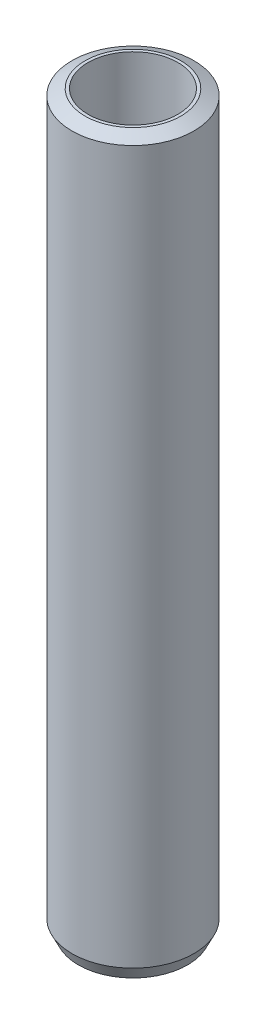
ISO-10303-21;
HEADER;
FILE_DESCRIPTION(('STEP AP214'),'2;1');
FILE_NAME('part.step','',(''),(''),'','','');
FILE_SCHEMA(('AUTOMOTIVE_DESIGN { 1 0 10303 214 1 1 1 1 }'));
ENDSEC;
DATA;
#1=APPLICATION_CONTEXT('core data for automotive mechanical design processes');
#2=APPLICATION_PROTOCOL_DEFINITION('international standard','automotive_design',2000,#1);
#3=PRODUCT_CONTEXT('',#1,'mechanical');
#4=PRODUCT('Part','Part','',(#3));
#5=PRODUCT_RELATED_PRODUCT_CATEGORY('part','',(#4));
#6=PRODUCT_DEFINITION_FORMATION('','',#4);
#7=PRODUCT_DEFINITION_CONTEXT('part definition',#1,'design');
#8=PRODUCT_DEFINITION('design','',#6,#7);
#9=PRODUCT_DEFINITION_SHAPE('','',#8);
#10=(LENGTH_UNIT() NAMED_UNIT(*) SI_UNIT(.MILLI.,.METRE.));
#11=(NAMED_UNIT(*) PLANE_ANGLE_UNIT() SI_UNIT($,.RADIAN.));
#12=(NAMED_UNIT(*) SI_UNIT($,.STERADIAN.) SOLID_ANGLE_UNIT());
#13=UNCERTAINTY_MEASURE_WITH_UNIT(LENGTH_MEASURE(1.E-05),#10,'distance_accuracy_value','');
#14=(GEOMETRIC_REPRESENTATION_CONTEXT(3) GLOBAL_UNCERTAINTY_ASSIGNED_CONTEXT((#13)) GLOBAL_UNIT_ASSIGNED_CONTEXT((#10,
#11,#12)) REPRESENTATION_CONTEXT('',''));
#15=CARTESIAN_POINT('',(0.,0.,0.));
#16=DIRECTION('',(0.,0.,1.));
#17=DIRECTION('',(1.,0.,0.));
#18=AXIS2_PLACEMENT_3D('',#15,#16,#17);
#19=CARTESIAN_POINT('',(0.,600.,0.));
#20=DIRECTION('',(0.,-1.,0.));
#21=DIRECTION('',(0.,0.,-1.));
#22=AXIS2_PLACEMENT_3D('',#19,#20,#21);
#23=CYLINDRICAL_SURFACE('',#22,50.);
#24=CARTESIAN_POINT('',(0.,594.768643446962,0.));
#25=DIRECTION('',(0.,1.,0.));
#26=DIRECTION('',(0.,0.,1.));
#27=AXIS2_PLACEMENT_3D('',#24,#25,#26);
#28=CIRCLE('',#27,50.);
#29=CARTESIAN_POINT('',(0.,594.768643446962,50.));
#30=VERTEX_POINT('',#29);
#31=EDGE_CURVE('E50',#30,#30,#28,.F.);
#32=ORIENTED_EDGE('',*,*,#31,.T.);
#33=EDGE_LOOP('',(#32));
#34=FACE_BOUND('',#33,.T.);
#35=CARTESIAN_POINT('',(0.,10.6760172350044,0.));
#36=DIRECTION('',(0.,1.,0.));
#37=DIRECTION('',(0.,0.,1.));
#38=AXIS2_PLACEMENT_3D('',#35,#36,#37);
#39=CIRCLE('',#38,50.);
#40=CARTESIAN_POINT('',(0.,10.6760172350044,50.));
#41=VERTEX_POINT('',#40);
#42=EDGE_CURVE('E51',#41,#41,#39,.T.);
#43=ORIENTED_EDGE('',*,*,#42,.T.);
#44=EDGE_LOOP('',(#43));
#45=FACE_BOUND('',#44,.T.);
#46=ADVANCED_FACE('F39',(#34,#45),#23,.T.);
#47=CARTESIAN_POINT('',(0.,600.,0.));
#48=DIRECTION('',(0.,1.,0.));
#49=DIRECTION('',(0.,0.,1.));
#50=AXIS2_PLACEMENT_3D('',#47,#48,#49);
#51=PLANE('',#50);
#52=CARTESIAN_POINT('',(0.,600.,0.));
#53=DIRECTION('',(0.,1.,0.));
#54=DIRECTION('',(0.,0.,1.));
#55=AXIS2_PLACEMENT_3D('',#52,#53,#54);
#56=CIRCLE('',#55,39.3239827649952);
#57=CARTESIAN_POINT('',(0.,600.,39.3239827649952));
#58=VERTEX_POINT('',#57);
#59=EDGE_CURVE('E54',#58,#58,#56,.T.);
#60=ORIENTED_EDGE('',*,*,#59,.T.);
#61=EDGE_LOOP('',(#60));
#62=FACE_BOUND('',#61,.T.);
#63=CARTESIAN_POINT('',(0.,600.,0.));
#64=DIRECTION('',(0.,1.,0.));
#65=DIRECTION('',(0.,0.,1.));
#66=AXIS2_PLACEMENT_3D('',#63,#64,#65);
#67=CIRCLE('',#66,36.8508872725705);
#68=CARTESIAN_POINT('',(0.,600.,36.8508872725705));
#69=VERTEX_POINT('',#68);
#70=EDGE_CURVE('E58',#69,#69,#67,.T.);
#71=ORIENTED_EDGE('',*,*,#70,.F.);
#72=EDGE_LOOP('',(#71));
#73=FACE_BOUND('',#72,.T.);
#74=ADVANCED_FACE('F69',(#62,#73),#51,.T.);
#75=CARTESIAN_POINT('',(0.,0.,0.));
#76=DIRECTION('',(0.,1.,0.));
#77=DIRECTION('',(0.,0.,1.));
#78=AXIS2_PLACEMENT_3D('',#75,#76,#77);
#79=PLANE('',#78);
#80=CARTESIAN_POINT('',(0.,0.,0.));
#81=DIRECTION('',(0.,1.,0.));
#82=DIRECTION('',(0.,0.,1.));
#83=AXIS2_PLACEMENT_3D('',#80,#81,#82);
#84=CIRCLE('',#83,44.7686434469622);
#85=CARTESIAN_POINT('',(0.,0.,44.7686434469622));
#86=VERTEX_POINT('',#85);
#87=EDGE_CURVE('E10',#86,#86,#84,.F.);
#88=ORIENTED_EDGE('',*,*,#87,.T.);
#89=EDGE_LOOP('',(#88));
#90=FACE_BOUND('',#89,.T.);
#91=CARTESIAN_POINT('',(0.,0.,0.));
#92=DIRECTION('',(0.,1.,0.));
#93=DIRECTION('',(0.,0.,1.));
#94=AXIS2_PLACEMENT_3D('',#91,#92,#93);
#95=CIRCLE('',#94,36.8508872725705);
#96=CARTESIAN_POINT('',(0.,0.,36.8508872725705));
#97=VERTEX_POINT('',#96);
#98=EDGE_CURVE('E63',#97,#97,#95,.T.);
#99=ORIENTED_EDGE('',*,*,#98,.T.);
#100=EDGE_LOOP('',(#99));
#101=FACE_BOUND('',#100,.T.);
#102=ADVANCED_FACE('F75',(#90,#101),#79,.F.);
#103=CARTESIAN_POINT('',(0.,600.,0.));
#104=DIRECTION('',(0.,-1.,0.));
#105=DIRECTION('',(0.,0.,-1.));
#106=AXIS2_PLACEMENT_3D('',#103,#104,#105);
#107=CYLINDRICAL_SURFACE('',#106,36.8508872725705);
#108=ORIENTED_EDGE('',*,*,#70,.T.);
#109=EDGE_LOOP('',(#108));
#110=FACE_BOUND('',#109,.T.);
#111=ORIENTED_EDGE('',*,*,#98,.F.);
#112=EDGE_LOOP('',(#111));
#113=FACE_BOUND('',#112,.T.);
#114=ADVANCED_FACE('F70',(#110,#113),#107,.F.);
#115=CARTESIAN_POINT('',(0.,600.,0.));
#116=DIRECTION('',(0.,-1.,0.));
#117=DIRECTION('',(0.,0.,-1.));
#118=AXIS2_PLACEMENT_3D('',#115,#116,#117);
#119=CONICAL_SURFACE('',#118,39.3239827649952,1.11517250795433);
#120=ORIENTED_EDGE('',*,*,#31,.F.);
#121=EDGE_LOOP('',(#120));
#122=FACE_BOUND('',#121,.T.);
#123=ORIENTED_EDGE('',*,*,#59,.F.);
#124=EDGE_LOOP('',(#123));
#125=FACE_BOUND('',#124,.T.);
#126=ADVANCED_FACE('F81',(#122,#125),#119,.T.);
#127=CARTESIAN_POINT('',(0.,10.6760172350044,0.));
#128=DIRECTION('',(0.,1.,0.));
#129=DIRECTION('',(0.,0.,1.));
#130=AXIS2_PLACEMENT_3D('',#127,#128,#129);
#131=CONICAL_SURFACE('',#130,50.,0.455623818840563);
#132=ORIENTED_EDGE('',*,*,#87,.F.);
#133=EDGE_LOOP('',(#132));
#134=FACE_BOUND('',#133,.T.);
#135=ORIENTED_EDGE('',*,*,#42,.F.);
#136=EDGE_LOOP('',(#135));
#137=FACE_BOUND('',#136,.T.);
#138=ADVANCED_FACE('F45',(#134,#137),#131,.T.);
#139=CLOSED_SHELL('',(#46,#74,#102,#114,#126,#138));
#140=MANIFOLD_SOLID_BREP('B2',#139);
#141=ADVANCED_BREP_SHAPE_REPRESENTATION('',(#18,#140),#14);
#142=SHAPE_DEFINITION_REPRESENTATION(#9,#141);
ENDSEC;
END-ISO-10303-21;
